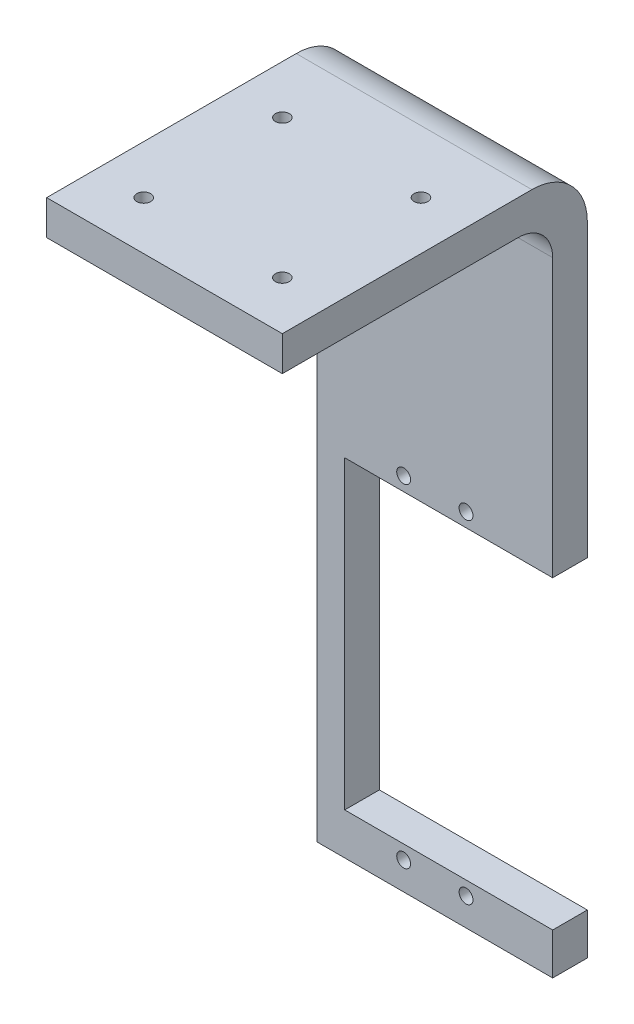
ISO-10303-21;
HEADER;
FILE_DESCRIPTION(('STEP AP214'),'2;1');
FILE_NAME('part.step','',(''),(''),'','','');
FILE_SCHEMA(('AUTOMOTIVE_DESIGN { 1 0 10303 214 1 1 1 1 }'));
ENDSEC;
DATA;
#1=APPLICATION_CONTEXT('core data for automotive mechanical design processes');
#2=APPLICATION_PROTOCOL_DEFINITION('international standard','automotive_design',2000,#1);
#3=PRODUCT_CONTEXT('',#1,'mechanical');
#4=PRODUCT('Part','Part','',(#3));
#5=PRODUCT_RELATED_PRODUCT_CATEGORY('part','',(#4));
#6=PRODUCT_DEFINITION_FORMATION('','',#4);
#7=PRODUCT_DEFINITION_CONTEXT('part definition',#1,'design');
#8=PRODUCT_DEFINITION('design','',#6,#7);
#9=PRODUCT_DEFINITION_SHAPE('','',#8);
#10=(LENGTH_UNIT() NAMED_UNIT(*) SI_UNIT(.MILLI.,.METRE.));
#11=(NAMED_UNIT(*) PLANE_ANGLE_UNIT() SI_UNIT($,.RADIAN.));
#12=(NAMED_UNIT(*) SI_UNIT($,.STERADIAN.) SOLID_ANGLE_UNIT());
#13=UNCERTAINTY_MEASURE_WITH_UNIT(LENGTH_MEASURE(1.E-05),#10,'distance_accuracy_value','');
#14=(GEOMETRIC_REPRESENTATION_CONTEXT(3) GLOBAL_UNCERTAINTY_ASSIGNED_CONTEXT((#13)) GLOBAL_UNIT_ASSIGNED_CONTEXT((#10,
#11,#12)) REPRESENTATION_CONTEXT('',''));
#15=CARTESIAN_POINT('',(0.,0.,0.));
#16=DIRECTION('',(0.,0.,1.));
#17=DIRECTION('',(1.,0.,0.));
#18=AXIS2_PLACEMENT_3D('',#15,#16,#17);
#19=CARTESIAN_POINT('',(-13.,0.,5.));
#20=DIRECTION('',(1.,0.,0.));
#21=DIRECTION('',(0.,1.,0.));
#22=AXIS2_PLACEMENT_3D('',#19,#20,#21);
#23=PLANE('',#22);
#24=DIRECTION('',(0.,-1.,0.));
#25=VECTOR('',#24,1.);
#26=CARTESIAN_POINT('',(-13.,0.,0.));
#27=LINE('',#26,#25);
#28=CARTESIAN_POINT('',(-13.,22.,0.));
#29=VERTEX_POINT('',#28);
#30=CARTESIAN_POINT('',(-13.,-22.,0.));
#31=VERTEX_POINT('',#30);
#32=EDGE_CURVE('E194',#29,#31,#27,.T.);
#33=ORIENTED_EDGE('',*,*,#32,.F.);
#34=DIRECTION('',(0.,0.,-1.));
#35=VECTOR('',#34,1.);
#36=CARTESIAN_POINT('',(-13.,22.,5.));
#37=LINE('',#36,#35);
#38=CARTESIAN_POINT('',(-13.,22.,5.));
#39=VERTEX_POINT('',#38);
#40=EDGE_CURVE('E229',#39,#29,#37,.T.);
#41=ORIENTED_EDGE('',*,*,#40,.F.);
#42=DIRECTION('',(0.,-1.,0.));
#43=VECTOR('',#42,1.);
#44=CARTESIAN_POINT('',(-13.,0.,5.));
#45=LINE('',#44,#43);
#46=CARTESIAN_POINT('',(-13.,-22.,5.));
#47=VERTEX_POINT('',#46);
#48=EDGE_CURVE('E167',#39,#47,#45,.T.);
#49=ORIENTED_EDGE('',*,*,#48,.T.);
#50=DIRECTION('',(0.,0.,-1.));
#51=VECTOR('',#50,1.);
#52=CARTESIAN_POINT('',(-13.,-22.,5.));
#53=LINE('',#52,#51);
#54=EDGE_CURVE('E187',#47,#31,#53,.T.);
#55=ORIENTED_EDGE('',*,*,#54,.T.);
#56=EDGE_LOOP('',(#33,#41,#49,#55));
#57=FACE_BOUND('',#56,.T.);
#58=ADVANCED_FACE('F35',(#57),#23,.T.);
#59=CARTESIAN_POINT('',(0.,22.,5.));
#60=DIRECTION('',(0.,1.,0.));
#61=DIRECTION('',(0.,0.,1.));
#62=AXIS2_PLACEMENT_3D('',#59,#60,#61);
#63=PLANE('',#62);
#64=DIRECTION('',(1.,0.,0.));
#65=VECTOR('',#64,1.);
#66=CARTESIAN_POINT('',(0.,22.,0.));
#67=LINE('',#66,#65);
#68=CARTESIAN_POINT('',(17.,22.,0.));
#69=VERTEX_POINT('',#68);
#70=EDGE_CURVE('E197',#29,#69,#67,.T.);
#71=ORIENTED_EDGE('',*,*,#70,.T.);
#72=DIRECTION('',(0.,0.,-1.));
#73=VECTOR('',#72,1.);
#74=CARTESIAN_POINT('',(17.,22.,5.));
#75=LINE('',#74,#73);
#76=CARTESIAN_POINT('',(17.,22.,5.));
#77=VERTEX_POINT('',#76);
#78=EDGE_CURVE('E226',#77,#69,#75,.T.);
#79=ORIENTED_EDGE('',*,*,#78,.F.);
#80=DIRECTION('',(1.,0.,0.));
#81=VECTOR('',#80,1.);
#82=CARTESIAN_POINT('',(0.,22.,5.));
#83=LINE('',#82,#81);
#84=EDGE_CURVE('E170',#39,#77,#83,.T.);
#85=ORIENTED_EDGE('',*,*,#84,.F.);
#86=ORIENTED_EDGE('',*,*,#40,.T.);
#87=EDGE_LOOP('',(#71,#79,#85,#86));
#88=FACE_BOUND('',#87,.T.);
#89=ADVANCED_FACE('F297',(#88),#63,.F.);
#90=CARTESIAN_POINT('',(17.,0.,5.));
#91=DIRECTION('',(-1.,0.,0.));
#92=DIRECTION('',(0.,0.,1.));
#93=AXIS2_PLACEMENT_3D('',#90,#91,#92);
#94=PLANE('',#93);
#95=DIRECTION('',(0.,1.,0.));
#96=VECTOR('',#95,1.);
#97=CARTESIAN_POINT('',(17.,0.,0.));
#98=LINE('',#97,#96);
#99=CARTESIAN_POINT('',(17.,64.,0.));
#100=VERTEX_POINT('',#99);
#101=EDGE_CURVE('E200',#69,#100,#98,.T.);
#102=ORIENTED_EDGE('',*,*,#101,.T.);
#103=CARTESIAN_POINT('',(17.,64.,8.));
#104=DIRECTION('',(-1.,0.,0.));
#105=DIRECTION('',(0.,0.,1.));
#106=AXIS2_PLACEMENT_3D('',#103,#104,#105);
#107=CIRCLE('',#106,8.);
#108=CARTESIAN_POINT('',(17.,72.,8.));
#109=VERTEX_POINT('',#108);
#110=EDGE_CURVE('E236',#100,#109,#107,.F.);
#111=ORIENTED_EDGE('',*,*,#110,.T.);
#112=DIRECTION('',(0.,0.,-1.));
#113=VECTOR('',#112,1.);
#114=CARTESIAN_POINT('',(17.,72.,0.));
#115=LINE('',#114,#113);
#116=CARTESIAN_POINT('',(17.,72.,44.));
#117=VERTEX_POINT('',#116);
#118=EDGE_CURVE('E143',#117,#109,#115,.T.);
#119=ORIENTED_EDGE('',*,*,#118,.F.);
#120=DIRECTION('',(0.,-1.,0.));
#121=VECTOR('',#120,1.);
#122=CARTESIAN_POINT('',(17.,72.,44.));
#123=LINE('',#122,#121);
#124=CARTESIAN_POINT('',(17.,67.,44.));
#125=VERTEX_POINT('',#124);
#126=EDGE_CURVE('E141',#117,#125,#123,.T.);
#127=ORIENTED_EDGE('',*,*,#126,.T.);
#128=DIRECTION('',(0.,0.,-1.));
#129=VECTOR('',#128,1.);
#130=CARTESIAN_POINT('',(17.,67.,0.));
#131=LINE('',#130,#129);
#132=CARTESIAN_POINT('',(17.,67.,10.));
#133=VERTEX_POINT('',#132);
#134=EDGE_CURVE('E134',#125,#133,#131,.T.);
#135=ORIENTED_EDGE('',*,*,#134,.T.);
#136=CARTESIAN_POINT('',(17.,62.,10.));
#137=DIRECTION('',(-1.,0.,0.));
#138=DIRECTION('',(0.,0.,1.));
#139=AXIS2_PLACEMENT_3D('',#136,#137,#138);
#140=CIRCLE('',#139,5.);
#141=CARTESIAN_POINT('',(17.,62.,5.));
#142=VERTEX_POINT('',#141);
#143=EDGE_CURVE('E43',#133,#142,#140,.T.);
#144=ORIENTED_EDGE('',*,*,#143,.T.);
#145=DIRECTION('',(0.,1.,0.));
#146=VECTOR('',#145,1.);
#147=CARTESIAN_POINT('',(17.,0.,5.));
#148=LINE('',#147,#146);
#149=EDGE_CURVE('E173',#77,#142,#148,.T.);
#150=ORIENTED_EDGE('',*,*,#149,.F.);
#151=ORIENTED_EDGE('',*,*,#78,.T.);
#152=EDGE_LOOP('',(#102,#111,#119,#127,#135,#144,#150,#151));
#153=FACE_BOUND('',#152,.T.);
#154=ADVANCED_FACE('F247',(#153),#94,.F.);
#155=CARTESIAN_POINT('',(-17.,0.,5.));
#156=DIRECTION('',(-1.,0.,0.));
#157=DIRECTION('',(0.,0.,1.));
#158=AXIS2_PLACEMENT_3D('',#155,#156,#157);
#159=PLANE('',#158);
#160=DIRECTION('',(0.,0.,1.));
#161=VECTOR('',#160,1.);
#162=CARTESIAN_POINT('',(-17.,72.,0.));
#163=LINE('',#162,#161);
#164=CARTESIAN_POINT('',(-17.,72.,8.));
#165=VERTEX_POINT('',#164);
#166=CARTESIAN_POINT('',(-17.,72.,44.));
#167=VERTEX_POINT('',#166);
#168=EDGE_CURVE('E123',#165,#167,#163,.T.);
#169=ORIENTED_EDGE('',*,*,#168,.F.);
#170=CARTESIAN_POINT('',(-17.,64.,8.));
#171=DIRECTION('',(-1.,0.,0.));
#172=DIRECTION('',(0.,0.,1.));
#173=AXIS2_PLACEMENT_3D('',#170,#171,#172);
#174=CIRCLE('',#173,8.);
#175=CARTESIAN_POINT('',(-17.,64.,0.));
#176=VERTEX_POINT('',#175);
#177=EDGE_CURVE('E232',#165,#176,#174,.T.);
#178=ORIENTED_EDGE('',*,*,#177,.T.);
#179=DIRECTION('',(0.,1.,0.));
#180=VECTOR('',#179,1.);
#181=CARTESIAN_POINT('',(-17.,0.,0.));
#182=LINE('',#181,#180);
#183=CARTESIAN_POINT('',(-17.,-28.,0.));
#184=VERTEX_POINT('',#183);
#185=EDGE_CURVE('E203',#184,#176,#182,.T.);
#186=ORIENTED_EDGE('',*,*,#185,.F.);
#187=DIRECTION('',(0.,0.,-1.));
#188=VECTOR('',#187,1.);
#189=CARTESIAN_POINT('',(-17.,-28.,5.));
#190=LINE('',#189,#188);
#191=CARTESIAN_POINT('',(-17.,-28.,5.));
#192=VERTEX_POINT('',#191);
#193=EDGE_CURVE('E224',#192,#184,#190,.T.);
#194=ORIENTED_EDGE('',*,*,#193,.F.);
#195=DIRECTION('',(0.,1.,0.));
#196=VECTOR('',#195,1.);
#197=CARTESIAN_POINT('',(-17.,0.,5.));
#198=LINE('',#197,#196);
#199=CARTESIAN_POINT('',(-17.,62.,5.));
#200=VERTEX_POINT('',#199);
#201=EDGE_CURVE('E175',#192,#200,#198,.T.);
#202=ORIENTED_EDGE('',*,*,#201,.T.);
#203=CARTESIAN_POINT('',(-17.,62.,10.));
#204=DIRECTION('',(-1.,0.,0.));
#205=DIRECTION('',(0.,0.,1.));
#206=AXIS2_PLACEMENT_3D('',#203,#204,#205);
#207=CIRCLE('',#206,5.);
#208=CARTESIAN_POINT('',(-17.,67.,10.));
#209=VERTEX_POINT('',#208);
#210=EDGE_CURVE('E11',#200,#209,#207,.F.);
#211=ORIENTED_EDGE('',*,*,#210,.T.);
#212=DIRECTION('',(0.,0.,1.));
#213=VECTOR('',#212,1.);
#214=CARTESIAN_POINT('',(-17.,67.,0.));
#215=LINE('',#214,#213);
#216=CARTESIAN_POINT('',(-17.,67.,44.));
#217=VERTEX_POINT('',#216);
#218=EDGE_CURVE('E147',#209,#217,#215,.T.);
#219=ORIENTED_EDGE('',*,*,#218,.T.);
#220=DIRECTION('',(0.,-1.,0.));
#221=VECTOR('',#220,1.);
#222=CARTESIAN_POINT('',(-17.,72.,44.));
#223=LINE('',#222,#221);
#224=EDGE_CURVE('E139',#167,#217,#223,.T.);
#225=ORIENTED_EDGE('',*,*,#224,.F.);
#226=EDGE_LOOP('',(#169,#178,#186,#194,#202,#211,#219,#225));
#227=FACE_BOUND('',#226,.T.);
#228=ADVANCED_FACE('F145',(#227),#159,.T.);
#229=CARTESIAN_POINT('',(0.,-28.,5.));
#230=DIRECTION('',(0.,1.,0.));
#231=DIRECTION('',(0.,0.,1.));
#232=AXIS2_PLACEMENT_3D('',#229,#230,#231);
#233=PLANE('',#232);
#234=DIRECTION('',(1.,0.,0.));
#235=VECTOR('',#234,1.);
#236=CARTESIAN_POINT('',(0.,-28.,0.));
#237=LINE('',#236,#235);
#238=CARTESIAN_POINT('',(17.,-28.,0.));
#239=VERTEX_POINT('',#238);
#240=EDGE_CURVE('E206',#184,#239,#237,.T.);
#241=ORIENTED_EDGE('',*,*,#240,.T.);
#242=DIRECTION('',(0.,0.,-1.));
#243=VECTOR('',#242,1.);
#244=CARTESIAN_POINT('',(17.,-28.,5.));
#245=LINE('',#244,#243);
#246=CARTESIAN_POINT('',(17.,-28.,5.));
#247=VERTEX_POINT('',#246);
#248=EDGE_CURVE('E221',#247,#239,#245,.T.);
#249=ORIENTED_EDGE('',*,*,#248,.F.);
#250=DIRECTION('',(1.,0.,0.));
#251=VECTOR('',#250,1.);
#252=CARTESIAN_POINT('',(0.,-28.,5.));
#253=LINE('',#252,#251);
#254=EDGE_CURVE('E177',#192,#247,#253,.T.);
#255=ORIENTED_EDGE('',*,*,#254,.F.);
#256=ORIENTED_EDGE('',*,*,#193,.T.);
#257=EDGE_LOOP('',(#241,#249,#255,#256));
#258=FACE_BOUND('',#257,.T.);
#259=ADVANCED_FACE('F341',(#258),#233,.F.);
#260=CARTESIAN_POINT('',(17.,0.,5.));
#261=DIRECTION('',(-1.,0.,0.));
#262=DIRECTION('',(0.,0.,1.));
#263=AXIS2_PLACEMENT_3D('',#260,#261,#262);
#264=PLANE('',#263);
#265=DIRECTION('',(0.,1.,0.));
#266=VECTOR('',#265,1.);
#267=CARTESIAN_POINT('',(17.,0.,0.));
#268=LINE('',#267,#266);
#269=CARTESIAN_POINT('',(17.,-22.,0.));
#270=VERTEX_POINT('',#269);
#271=EDGE_CURVE('E209',#239,#270,#268,.T.);
#272=ORIENTED_EDGE('',*,*,#271,.T.);
#273=DIRECTION('',(0.,0.,-1.));
#274=VECTOR('',#273,1.);
#275=CARTESIAN_POINT('',(17.,-22.,5.));
#276=LINE('',#275,#274);
#277=CARTESIAN_POINT('',(17.,-22.,5.));
#278=VERTEX_POINT('',#277);
#279=EDGE_CURVE('E218',#278,#270,#276,.T.);
#280=ORIENTED_EDGE('',*,*,#279,.F.);
#281=DIRECTION('',(0.,1.,0.));
#282=VECTOR('',#281,1.);
#283=CARTESIAN_POINT('',(17.,0.,5.));
#284=LINE('',#283,#282);
#285=EDGE_CURVE('E180',#247,#278,#284,.T.);
#286=ORIENTED_EDGE('',*,*,#285,.F.);
#287=ORIENTED_EDGE('',*,*,#248,.T.);
#288=EDGE_LOOP('',(#272,#280,#286,#287));
#289=FACE_BOUND('',#288,.T.);
#290=ADVANCED_FACE('F362',(#289),#264,.F.);
#291=CARTESIAN_POINT('',(0.,-22.,5.));
#292=DIRECTION('',(0.,-1.,0.));
#293=DIRECTION('',(1.,0.,0.));
#294=AXIS2_PLACEMENT_3D('',#291,#292,#293);
#295=PLANE('',#294);
#296=DIRECTION('',(-1.,0.,0.));
#297=VECTOR('',#296,1.);
#298=CARTESIAN_POINT('',(0.,-22.,0.));
#299=LINE('',#298,#297);
#300=EDGE_CURVE('E212',#270,#31,#299,.T.);
#301=ORIENTED_EDGE('',*,*,#300,.T.);
#302=ORIENTED_EDGE('',*,*,#54,.F.);
#303=DIRECTION('',(-1.,0.,0.));
#304=VECTOR('',#303,1.);
#305=CARTESIAN_POINT('',(0.,-22.,5.));
#306=LINE('',#305,#304);
#307=EDGE_CURVE('E183',#278,#47,#306,.T.);
#308=ORIENTED_EDGE('',*,*,#307,.F.);
#309=ORIENTED_EDGE('',*,*,#279,.T.);
#310=EDGE_LOOP('',(#301,#302,#308,#309));
#311=FACE_BOUND('',#310,.T.);
#312=ADVANCED_FACE('F312',(#311),#295,.F.);
#313=CARTESIAN_POINT('',(4.5,24.,5.));
#314=DIRECTION('',(0.,0.,-1.));
#315=DIRECTION('',(-1.,0.,0.));
#316=AXIS2_PLACEMENT_3D('',#313,#314,#315);
#317=CYLINDRICAL_SURFACE('',#316,1.);
#318=CARTESIAN_POINT('',(4.5,24.,5.));
#319=DIRECTION('',(0.,0.,1.));
#320=DIRECTION('',(1.,0.,0.));
#321=AXIS2_PLACEMENT_3D('',#318,#319,#320);
#322=CIRCLE('',#321,1.);
#323=CARTESIAN_POINT('',(5.5,24.,5.));
#324=VERTEX_POINT('',#323);
#325=EDGE_CURVE('E164',#324,#324,#322,.T.);
#326=ORIENTED_EDGE('',*,*,#325,.T.);
#327=EDGE_LOOP('',(#326));
#328=FACE_BOUND('',#327,.T.);
#329=CARTESIAN_POINT('',(4.5,24.,0.));
#330=DIRECTION('',(0.,0.,1.));
#331=DIRECTION('',(1.,0.,0.));
#332=AXIS2_PLACEMENT_3D('',#329,#330,#331);
#333=CIRCLE('',#332,1.);
#334=CARTESIAN_POINT('',(5.5,24.,0.));
#335=VERTEX_POINT('',#334);
#336=EDGE_CURVE('E191',#335,#335,#333,.T.);
#337=ORIENTED_EDGE('',*,*,#336,.F.);
#338=EDGE_LOOP('',(#337));
#339=FACE_BOUND('',#338,.T.);
#340=ADVANCED_FACE('F308',(#328,#339),#317,.F.);
#341=CARTESIAN_POINT('',(-4.5,24.,5.));
#342=DIRECTION('',(0.,0.,-1.));
#343=DIRECTION('',(-1.,0.,0.));
#344=AXIS2_PLACEMENT_3D('',#341,#342,#343);
#345=CYLINDRICAL_SURFACE('',#344,1.);
#346=CARTESIAN_POINT('',(-4.5,24.,5.));
#347=DIRECTION('',(0.,0.,1.));
#348=DIRECTION('',(1.,0.,0.));
#349=AXIS2_PLACEMENT_3D('',#346,#347,#348);
#350=CIRCLE('',#349,1.);
#351=CARTESIAN_POINT('',(-3.5,24.,5.));
#352=VERTEX_POINT('',#351);
#353=EDGE_CURVE('E160',#352,#352,#350,.F.);
#354=ORIENTED_EDGE('',*,*,#353,.F.);
#355=EDGE_LOOP('',(#354));
#356=FACE_BOUND('',#355,.T.);
#357=CARTESIAN_POINT('',(-4.5,24.,0.));
#358=DIRECTION('',(0.,0.,1.));
#359=DIRECTION('',(1.,0.,0.));
#360=AXIS2_PLACEMENT_3D('',#357,#358,#359);
#361=CIRCLE('',#360,1.);
#362=CARTESIAN_POINT('',(-3.5,24.,0.));
#363=VERTEX_POINT('',#362);
#364=EDGE_CURVE('E152',#363,#363,#361,.F.);
#365=ORIENTED_EDGE('',*,*,#364,.T.);
#366=EDGE_LOOP('',(#365));
#367=FACE_BOUND('',#366,.T.);
#368=ADVANCED_FACE('F311',(#356,#367),#345,.F.);
#369=CARTESIAN_POINT('',(-4.50000000000004,-24.,5.));
#370=DIRECTION('',(0.,0.,-1.));
#371=DIRECTION('',(-1.,0.,0.));
#372=AXIS2_PLACEMENT_3D('',#369,#370,#371);
#373=CYLINDRICAL_SURFACE('',#372,1.);
#374=CARTESIAN_POINT('',(-4.50000000000004,-24.,5.));
#375=DIRECTION('',(0.,0.,1.));
#376=DIRECTION('',(1.,0.,0.));
#377=AXIS2_PLACEMENT_3D('',#374,#375,#376);
#378=CIRCLE('',#377,1.);
#379=CARTESIAN_POINT('',(-3.50000000000004,-24.,5.));
#380=VERTEX_POINT('',#379);
#381=EDGE_CURVE('E157',#380,#380,#378,.T.);
#382=ORIENTED_EDGE('',*,*,#381,.T.);
#383=EDGE_LOOP('',(#382));
#384=FACE_BOUND('',#383,.T.);
#385=CARTESIAN_POINT('',(-4.50000000000004,-24.,0.));
#386=DIRECTION('',(0.,0.,1.));
#387=DIRECTION('',(1.,0.,0.));
#388=AXIS2_PLACEMENT_3D('',#385,#386,#387);
#389=CIRCLE('',#388,1.);
#390=CARTESIAN_POINT('',(-3.50000000000004,-24.,0.));
#391=VERTEX_POINT('',#390);
#392=EDGE_CURVE('E149',#391,#391,#389,.T.);
#393=ORIENTED_EDGE('',*,*,#392,.F.);
#394=EDGE_LOOP('',(#393));
#395=FACE_BOUND('',#394,.T.);
#396=ADVANCED_FACE('F316',(#384,#395),#373,.F.);
#397=CARTESIAN_POINT('',(4.49999999999996,-24.,5.));
#398=DIRECTION('',(0.,0.,-1.));
#399=DIRECTION('',(-1.,0.,0.));
#400=AXIS2_PLACEMENT_3D('',#397,#398,#399);
#401=CYLINDRICAL_SURFACE('',#400,1.);
#402=CARTESIAN_POINT('',(4.49999999999996,-24.,5.));
#403=DIRECTION('',(0.,0.,1.));
#404=DIRECTION('',(1.,0.,0.));
#405=AXIS2_PLACEMENT_3D('',#402,#403,#404);
#406=CIRCLE('',#405,1.);
#407=CARTESIAN_POINT('',(5.49999999999996,-24.,5.));
#408=VERTEX_POINT('',#407);
#409=EDGE_CURVE('E185',#408,#408,#406,.F.);
#410=ORIENTED_EDGE('',*,*,#409,.F.);
#411=EDGE_LOOP('',(#410));
#412=FACE_BOUND('',#411,.T.);
#413=CARTESIAN_POINT('',(4.49999999999996,-24.,0.));
#414=DIRECTION('',(0.,0.,1.));
#415=DIRECTION('',(1.,0.,0.));
#416=AXIS2_PLACEMENT_3D('',#413,#414,#415);
#417=CIRCLE('',#416,1.);
#418=CARTESIAN_POINT('',(5.49999999999996,-24.,0.));
#419=VERTEX_POINT('',#418);
#420=EDGE_CURVE('E161',#419,#419,#417,.F.);
#421=ORIENTED_EDGE('',*,*,#420,.T.);
#422=EDGE_LOOP('',(#421));
#423=FACE_BOUND('',#422,.T.);
#424=ADVANCED_FACE('F319',(#412,#423),#401,.F.);
#425=CARTESIAN_POINT('',(0.,0.,5.));
#426=DIRECTION('',(0.,0.,1.));
#427=DIRECTION('',(1.,0.,0.));
#428=AXIS2_PLACEMENT_3D('',#425,#426,#427);
#429=PLANE('',#428);
#430=ORIENTED_EDGE('',*,*,#381,.F.);
#431=EDGE_LOOP('',(#430));
#432=FACE_BOUND('',#431,.T.);
#433=ORIENTED_EDGE('',*,*,#353,.T.);
#434=EDGE_LOOP('',(#433));
#435=FACE_BOUND('',#434,.T.);
#436=ORIENTED_EDGE('',*,*,#325,.F.);
#437=EDGE_LOOP('',(#436));
#438=FACE_BOUND('',#437,.T.);
#439=ORIENTED_EDGE('',*,*,#149,.T.);
#440=DIRECTION('',(1.,0.,0.));
#441=VECTOR('',#440,1.);
#442=CARTESIAN_POINT('',(0.,62.,5.));
#443=LINE('',#442,#441);
#444=EDGE_CURVE('E50',#142,#200,#443,.F.);
#445=ORIENTED_EDGE('',*,*,#444,.T.);
#446=ORIENTED_EDGE('',*,*,#201,.F.);
#447=ORIENTED_EDGE('',*,*,#254,.T.);
#448=ORIENTED_EDGE('',*,*,#285,.T.);
#449=ORIENTED_EDGE('',*,*,#307,.T.);
#450=ORIENTED_EDGE('',*,*,#48,.F.);
#451=ORIENTED_EDGE('',*,*,#84,.T.);
#452=EDGE_LOOP('',(#439,#445,#446,#447,#448,#449,#450,#451));
#453=FACE_BOUND('',#452,.T.);
#454=ORIENTED_EDGE('',*,*,#409,.T.);
#455=EDGE_LOOP('',(#454));
#456=FACE_BOUND('',#455,.T.);
#457=ADVANCED_FACE('F342',(#432,#435,#438,#453,#456),#429,.T.);
#458=CARTESIAN_POINT('',(0.,0.,0.));
#459=DIRECTION('',(0.,0.,1.));
#460=DIRECTION('',(1.,0.,0.));
#461=AXIS2_PLACEMENT_3D('',#458,#459,#460);
#462=PLANE('',#461);
#463=ORIENTED_EDGE('',*,*,#392,.T.);
#464=EDGE_LOOP('',(#463));
#465=FACE_BOUND('',#464,.T.);
#466=ORIENTED_EDGE('',*,*,#364,.F.);
#467=EDGE_LOOP('',(#466));
#468=FACE_BOUND('',#467,.T.);
#469=ORIENTED_EDGE('',*,*,#336,.T.);
#470=EDGE_LOOP('',(#469));
#471=FACE_BOUND('',#470,.T.);
#472=ORIENTED_EDGE('',*,*,#185,.T.);
#473=DIRECTION('',(-1.,0.,0.));
#474=VECTOR('',#473,1.);
#475=CARTESIAN_POINT('',(17.,64.,0.));
#476=LINE('',#475,#474);
#477=EDGE_CURVE('E234',#176,#100,#476,.F.);
#478=ORIENTED_EDGE('',*,*,#477,.T.);
#479=ORIENTED_EDGE('',*,*,#101,.F.);
#480=ORIENTED_EDGE('',*,*,#70,.F.);
#481=ORIENTED_EDGE('',*,*,#32,.T.);
#482=ORIENTED_EDGE('',*,*,#300,.F.);
#483=ORIENTED_EDGE('',*,*,#271,.F.);
#484=ORIENTED_EDGE('',*,*,#240,.F.);
#485=EDGE_LOOP('',(#472,#478,#479,#480,#481,#482,#483,#484));
#486=FACE_BOUND('',#485,.T.);
#487=ORIENTED_EDGE('',*,*,#420,.F.);
#488=EDGE_LOOP('',(#487));
#489=FACE_BOUND('',#488,.T.);
#490=ADVANCED_FACE('F290',(#465,#468,#471,#486,#489),#462,.F.);
#491=CARTESIAN_POINT('',(0.,67.,0.));
#492=DIRECTION('',(0.,1.,0.));
#493=DIRECTION('',(0.,0.,1.));
#494=AXIS2_PLACEMENT_3D('',#491,#492,#493);
#495=PLANE('',#494);
#496=CARTESIAN_POINT('',(-10.,67.,17.));
#497=DIRECTION('',(0.,1.,0.));
#498=DIRECTION('',(0.,0.,1.));
#499=AXIS2_PLACEMENT_3D('',#496,#497,#498);
#500=CIRCLE('',#499,1.);
#501=CARTESIAN_POINT('',(-10.,67.,18.));
#502=VERTEX_POINT('',#501);
#503=EDGE_CURVE('E254',#502,#502,#500,.T.);
#504=ORIENTED_EDGE('',*,*,#503,.T.);
#505=EDGE_LOOP('',(#504));
#506=FACE_BOUND('',#505,.T.);
#507=CARTESIAN_POINT('',(9.99999999999999,67.,17.));
#508=DIRECTION('',(0.,1.,0.));
#509=DIRECTION('',(0.,0.,-1.));
#510=AXIS2_PLACEMENT_3D('',#507,#508,#509);
#511=CIRCLE('',#510,0.999999999999988);
#512=CARTESIAN_POINT('',(9.99999999999999,67.,16.));
#513=VERTEX_POINT('',#512);
#514=EDGE_CURVE('E260',#513,#513,#511,.T.);
#515=ORIENTED_EDGE('',*,*,#514,.T.);
#516=EDGE_LOOP('',(#515));
#517=FACE_BOUND('',#516,.T.);
#518=CARTESIAN_POINT('',(10.,67.,37.));
#519=DIRECTION('',(0.,1.,0.));
#520=DIRECTION('',(0.,0.,1.));
#521=AXIS2_PLACEMENT_3D('',#518,#519,#520);
#522=CIRCLE('',#521,0.999999999999992);
#523=CARTESIAN_POINT('',(10.,67.,38.));
#524=VERTEX_POINT('',#523);
#525=EDGE_CURVE('E266',#524,#524,#522,.T.);
#526=ORIENTED_EDGE('',*,*,#525,.T.);
#527=EDGE_LOOP('',(#526));
#528=FACE_BOUND('',#527,.T.);
#529=CARTESIAN_POINT('',(-10.,67.,37.));
#530=DIRECTION('',(0.,1.,0.));
#531=DIRECTION('',(0.,0.,-1.));
#532=AXIS2_PLACEMENT_3D('',#529,#530,#531);
#533=CIRCLE('',#532,0.999999999999996);
#534=CARTESIAN_POINT('',(-10.,67.,36.));
#535=VERTEX_POINT('',#534);
#536=EDGE_CURVE('E272',#535,#535,#533,.T.);
#537=ORIENTED_EDGE('',*,*,#536,.T.);
#538=EDGE_LOOP('',(#537));
#539=FACE_BOUND('',#538,.T.);
#540=ORIENTED_EDGE('',*,*,#218,.F.);
#541=DIRECTION('',(1.,0.,0.));
#542=VECTOR('',#541,1.);
#543=CARTESIAN_POINT('',(0.,67.,10.));
#544=LINE('',#543,#542);
#545=EDGE_CURVE('E238',#209,#133,#544,.T.);
#546=ORIENTED_EDGE('',*,*,#545,.T.);
#547=ORIENTED_EDGE('',*,*,#134,.F.);
#548=DIRECTION('',(1.,0.,0.));
#549=VECTOR('',#548,1.);
#550=CARTESIAN_POINT('',(-17.,67.,44.));
#551=LINE('',#550,#549);
#552=EDGE_CURVE('E248',#217,#125,#551,.T.);
#553=ORIENTED_EDGE('',*,*,#552,.F.);
#554=EDGE_LOOP('',(#540,#546,#547,#553));
#555=FACE_BOUND('',#554,.T.);
#556=ADVANCED_FACE('F244',(#506,#517,#528,#539,#555),#495,.F.);
#557=CARTESIAN_POINT('',(0.,72.,0.));
#558=DIRECTION('',(0.,1.,0.));
#559=DIRECTION('',(0.,0.,1.));
#560=AXIS2_PLACEMENT_3D('',#557,#558,#559);
#561=PLANE('',#560);
#562=CARTESIAN_POINT('',(10.,72.,37.));
#563=DIRECTION('',(0.,1.,0.));
#564=DIRECTION('',(0.,0.,1.));
#565=AXIS2_PLACEMENT_3D('',#562,#563,#564);
#566=CIRCLE('',#565,0.999999999999992);
#567=CARTESIAN_POINT('',(10.,72.,38.));
#568=VERTEX_POINT('',#567);
#569=EDGE_CURVE('E263',#568,#568,#566,.T.);
#570=ORIENTED_EDGE('',*,*,#569,.F.);
#571=EDGE_LOOP('',(#570));
#572=FACE_BOUND('',#571,.T.);
#573=CARTESIAN_POINT('',(-10.,72.,17.));
#574=DIRECTION('',(0.,1.,0.));
#575=DIRECTION('',(0.,0.,1.));
#576=AXIS2_PLACEMENT_3D('',#573,#574,#575);
#577=CIRCLE('',#576,1.);
#578=CARTESIAN_POINT('',(-10.,72.,18.));
#579=VERTEX_POINT('',#578);
#580=EDGE_CURVE('E252',#579,#579,#577,.T.);
#581=ORIENTED_EDGE('',*,*,#580,.F.);
#582=EDGE_LOOP('',(#581));
#583=FACE_BOUND('',#582,.T.);
#584=ORIENTED_EDGE('',*,*,#118,.T.);
#585=DIRECTION('',(-1.,0.,0.));
#586=VECTOR('',#585,1.);
#587=CARTESIAN_POINT('',(-17.,72.,8.));
#588=LINE('',#587,#586);
#589=EDGE_CURVE('E131',#109,#165,#588,.T.);
#590=ORIENTED_EDGE('',*,*,#589,.T.);
#591=ORIENTED_EDGE('',*,*,#168,.T.);
#592=DIRECTION('',(1.,0.,0.));
#593=VECTOR('',#592,1.);
#594=CARTESIAN_POINT('',(-17.,72.,44.));
#595=LINE('',#594,#593);
#596=EDGE_CURVE('E128',#167,#117,#595,.T.);
#597=ORIENTED_EDGE('',*,*,#596,.T.);
#598=EDGE_LOOP('',(#584,#590,#591,#597));
#599=FACE_BOUND('',#598,.T.);
#600=CARTESIAN_POINT('',(9.99999999999999,72.,17.));
#601=DIRECTION('',(0.,1.,0.));
#602=DIRECTION('',(0.,0.,-1.));
#603=AXIS2_PLACEMENT_3D('',#600,#601,#602);
#604=CIRCLE('',#603,0.999999999999988);
#605=CARTESIAN_POINT('',(9.99999999999999,72.,16.));
#606=VERTEX_POINT('',#605);
#607=EDGE_CURVE('E257',#606,#606,#604,.T.);
#608=ORIENTED_EDGE('',*,*,#607,.F.);
#609=EDGE_LOOP('',(#608));
#610=FACE_BOUND('',#609,.T.);
#611=CARTESIAN_POINT('',(-10.,72.,37.));
#612=DIRECTION('',(0.,1.,0.));
#613=DIRECTION('',(0.,0.,-1.));
#614=AXIS2_PLACEMENT_3D('',#611,#612,#613);
#615=CIRCLE('',#614,0.999999999999996);
#616=CARTESIAN_POINT('',(-10.,72.,36.));
#617=VERTEX_POINT('',#616);
#618=EDGE_CURVE('E269',#617,#617,#615,.T.);
#619=ORIENTED_EDGE('',*,*,#618,.F.);
#620=EDGE_LOOP('',(#619));
#621=FACE_BOUND('',#620,.T.);
#622=ADVANCED_FACE('F126',(#572,#583,#599,#610,#621),#561,.T.);
#623=CARTESIAN_POINT('',(-17.,72.,44.));
#624=DIRECTION('',(0.,0.,-1.));
#625=DIRECTION('',(-1.,0.,0.));
#626=AXIS2_PLACEMENT_3D('',#623,#624,#625);
#627=PLANE('',#626);
#628=ORIENTED_EDGE('',*,*,#552,.T.);
#629=ORIENTED_EDGE('',*,*,#126,.F.);
#630=ORIENTED_EDGE('',*,*,#596,.F.);
#631=ORIENTED_EDGE('',*,*,#224,.T.);
#632=EDGE_LOOP('',(#628,#629,#630,#631));
#633=FACE_BOUND('',#632,.T.);
#634=ADVANCED_FACE('F138',(#633),#627,.F.);
#635=CARTESIAN_POINT('',(-10.,72.,17.));
#636=DIRECTION('',(0.,-1.,0.));
#637=DIRECTION('',(0.,0.,-1.));
#638=AXIS2_PLACEMENT_3D('',#635,#636,#637);
#639=CYLINDRICAL_SURFACE('',#638,1.);
#640=ORIENTED_EDGE('',*,*,#580,.T.);
#641=EDGE_LOOP('',(#640));
#642=FACE_BOUND('',#641,.T.);
#643=ORIENTED_EDGE('',*,*,#503,.F.);
#644=EDGE_LOOP('',(#643));
#645=FACE_BOUND('',#644,.T.);
#646=ADVANCED_FACE('F288',(#642,#645),#639,.F.);
#647=CARTESIAN_POINT('',(9.99999999999999,72.,17.));
#648=DIRECTION('',(0.,-1.,0.));
#649=DIRECTION('',(0.,0.,-1.));
#650=AXIS2_PLACEMENT_3D('',#647,#648,#649);
#651=CYLINDRICAL_SURFACE('',#650,0.999999999999988);
#652=ORIENTED_EDGE('',*,*,#607,.T.);
#653=EDGE_LOOP('',(#652));
#654=FACE_BOUND('',#653,.T.);
#655=ORIENTED_EDGE('',*,*,#514,.F.);
#656=EDGE_LOOP('',(#655));
#657=FACE_BOUND('',#656,.T.);
#658=ADVANCED_FACE('F446',(#654,#657),#651,.F.);
#659=CARTESIAN_POINT('',(10.,72.,37.));
#660=DIRECTION('',(0.,-1.,0.));
#661=DIRECTION('',(0.,0.,-1.));
#662=AXIS2_PLACEMENT_3D('',#659,#660,#661);
#663=CYLINDRICAL_SURFACE('',#662,0.999999999999992);
#664=ORIENTED_EDGE('',*,*,#569,.T.);
#665=EDGE_LOOP('',(#664));
#666=FACE_BOUND('',#665,.T.);
#667=ORIENTED_EDGE('',*,*,#525,.F.);
#668=EDGE_LOOP('',(#667));
#669=FACE_BOUND('',#668,.T.);
#670=ADVANCED_FACE('F328',(#666,#669),#663,.F.);
#671=CARTESIAN_POINT('',(-10.,72.,37.));
#672=DIRECTION('',(0.,-1.,0.));
#673=DIRECTION('',(0.,0.,-1.));
#674=AXIS2_PLACEMENT_3D('',#671,#672,#673);
#675=CYLINDRICAL_SURFACE('',#674,0.999999999999996);
#676=ORIENTED_EDGE('',*,*,#618,.T.);
#677=EDGE_LOOP('',(#676));
#678=FACE_BOUND('',#677,.T.);
#679=ORIENTED_EDGE('',*,*,#536,.F.);
#680=EDGE_LOOP('',(#679));
#681=FACE_BOUND('',#680,.T.);
#682=ADVANCED_FACE('F278',(#678,#681),#675,.F.);
#683=CARTESIAN_POINT('',(0.,64.,8.));
#684=DIRECTION('',(1.,0.,0.));
#685=DIRECTION('',(0.,0.,-1.));
#686=AXIS2_PLACEMENT_3D('',#683,#684,#685);
#687=CYLINDRICAL_SURFACE('',#686,8.);
#688=ORIENTED_EDGE('',*,*,#110,.F.);
#689=ORIENTED_EDGE('',*,*,#477,.F.);
#690=ORIENTED_EDGE('',*,*,#177,.F.);
#691=ORIENTED_EDGE('',*,*,#589,.F.);
#692=EDGE_LOOP('',(#688,#689,#690,#691));
#693=FACE_BOUND('',#692,.T.);
#694=ADVANCED_FACE('F321',(#693),#687,.T.);
#695=CARTESIAN_POINT('',(0.,62.,10.));
#696=DIRECTION('',(1.,0.,0.));
#697=DIRECTION('',(0.,0.,-1.));
#698=AXIS2_PLACEMENT_3D('',#695,#696,#697);
#699=CYLINDRICAL_SURFACE('',#698,5.);
#700=ORIENTED_EDGE('',*,*,#210,.F.);
#701=ORIENTED_EDGE('',*,*,#444,.F.);
#702=ORIENTED_EDGE('',*,*,#143,.F.);
#703=ORIENTED_EDGE('',*,*,#545,.F.);
#704=EDGE_LOOP('',(#700,#701,#702,#703));
#705=FACE_BOUND('',#704,.T.);
#706=ADVANCED_FACE('F37',(#705),#699,.F.);
#707=CLOSED_SHELL('',(#58,#89,#154,#228,#259,#290,#312,#340,#368,#396,#424,#457,#490,#556,#622,
#634,#646,#658,#670,#682,#694,#706));
#708=MANIFOLD_SOLID_BREP('B2',#707);
#709=ADVANCED_BREP_SHAPE_REPRESENTATION('',(#18,#708),#14);
#710=SHAPE_DEFINITION_REPRESENTATION(#9,#709);
ENDSEC;
END-ISO-10303-21;
